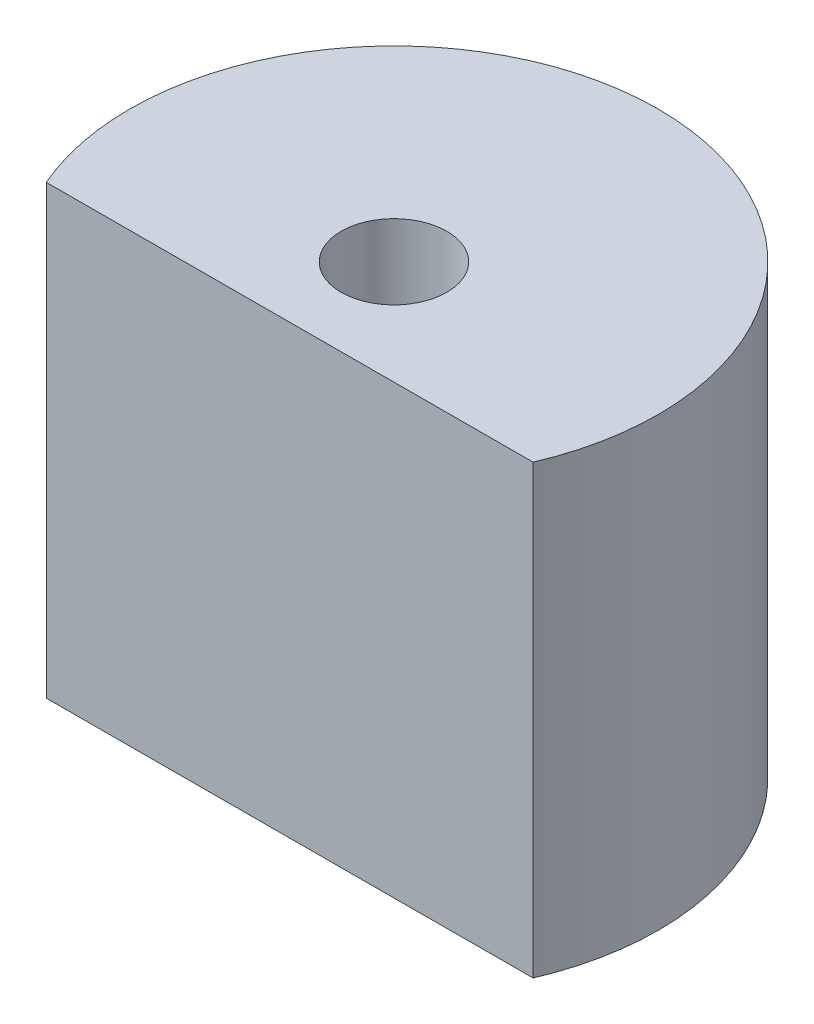
ISO-10303-21;
HEADER;
FILE_DESCRIPTION(('STEP AP214'),'2;1');
FILE_NAME('part.step','',(''),(''),'','','');
FILE_SCHEMA(('AUTOMOTIVE_DESIGN { 1 0 10303 214 1 1 1 1 }'));
ENDSEC;
DATA;
#1=APPLICATION_CONTEXT('core data for automotive mechanical design processes');
#2=APPLICATION_PROTOCOL_DEFINITION('international standard','automotive_design',2000,#1);
#3=PRODUCT_CONTEXT('',#1,'mechanical');
#4=PRODUCT('Part','Part','',(#3));
#5=PRODUCT_RELATED_PRODUCT_CATEGORY('part','',(#4));
#6=PRODUCT_DEFINITION_FORMATION('','',#4);
#7=PRODUCT_DEFINITION_CONTEXT('part definition',#1,'design');
#8=PRODUCT_DEFINITION('design','',#6,#7);
#9=PRODUCT_DEFINITION_SHAPE('','',#8);
#10=(LENGTH_UNIT() NAMED_UNIT(*) SI_UNIT(.MILLI.,.METRE.));
#11=(NAMED_UNIT(*) PLANE_ANGLE_UNIT() SI_UNIT($,.RADIAN.));
#12=(NAMED_UNIT(*) SI_UNIT($,.STERADIAN.) SOLID_ANGLE_UNIT());
#13=UNCERTAINTY_MEASURE_WITH_UNIT(LENGTH_MEASURE(1.E-05),#10,'distance_accuracy_value','');
#14=(GEOMETRIC_REPRESENTATION_CONTEXT(3) GLOBAL_UNCERTAINTY_ASSIGNED_CONTEXT((#13)) GLOBAL_UNIT_ASSIGNED_CONTEXT((#10,
#11,#12)) REPRESENTATION_CONTEXT('',''));
#15=CARTESIAN_POINT('',(0.,0.,0.));
#16=DIRECTION('',(0.,0.,1.));
#17=DIRECTION('',(1.,0.,0.));
#18=AXIS2_PLACEMENT_3D('',#15,#16,#17);
#19=CARTESIAN_POINT('',(0.,13.4112,0.));
#20=DIRECTION('',(0.,1.,0.));
#21=DIRECTION('',(0.,0.,1.));
#22=AXIS2_PLACEMENT_3D('',#19,#20,#21);
#23=PLANE('',#22);
#24=DIRECTION('',(-0.999997434066853,0.,0.00226536083440613));
#25=VECTOR('',#24,1.);
#26=CARTESIAN_POINT('',(0.00710669003863132,13.4112,3.13710367699671));
#27=LINE('',#26,#25);
#28=CARTESIAN_POINT('',(7.29834550402393,13.4112,3.12058634777084));
#29=VERTEX_POINT('',#28);
#30=CARTESIAN_POINT('',(-7.28413212394666,13.4112,3.15362100622257));
#31=VERTEX_POINT('',#30);
#32=EDGE_CURVE('E59',#29,#31,#27,.T.);
#33=ORIENTED_EDGE('',*,*,#32,.F.);
#34=CARTESIAN_POINT('',(0.,13.4112,0.));
#35=DIRECTION('',(0.,1.,0.));
#36=DIRECTION('',(0.,0.,1.));
#37=AXIS2_PLACEMENT_3D('',#34,#35,#36);
#38=CIRCLE('',#37,7.9375);
#39=EDGE_CURVE('E73',#29,#31,#38,.T.);
#40=ORIENTED_EDGE('',*,*,#39,.T.);
#41=EDGE_LOOP('',(#33,#40));
#42=FACE_BOUND('',#41,.T.);
#43=CARTESIAN_POINT('',(0.,13.4112,0.));
#44=DIRECTION('',(0.,1.,0.));
#45=DIRECTION('',(0.,0.,1.));
#46=AXIS2_PLACEMENT_3D('',#43,#44,#45);
#47=CIRCLE('',#46,1.5875);
#48=CARTESIAN_POINT('',(0.,13.4112,1.5875));
#49=VERTEX_POINT('',#48);
#50=EDGE_CURVE('E80',#49,#49,#47,.T.);
#51=ORIENTED_EDGE('',*,*,#50,.F.);
#52=EDGE_LOOP('',(#51));
#53=FACE_BOUND('',#52,.T.);
#54=ADVANCED_FACE('F44',(#42,#53),#23,.T.);
#55=CARTESIAN_POINT('',(0.,0.,0.));
#56=DIRECTION('',(0.,1.,0.));
#57=DIRECTION('',(0.,0.,1.));
#58=AXIS2_PLACEMENT_3D('',#55,#56,#57);
#59=PLANE('',#58);
#60=CARTESIAN_POINT('',(0.,0.,0.));
#61=DIRECTION('',(0.,1.,0.));
#62=DIRECTION('',(0.,0.,1.));
#63=AXIS2_PLACEMENT_3D('',#60,#61,#62);
#64=CIRCLE('',#63,7.9375);
#65=CARTESIAN_POINT('',(7.29834550402393,0.,3.12058634777084));
#66=VERTEX_POINT('',#65);
#67=CARTESIAN_POINT('',(-7.28413212394666,0.,3.15362100622257));
#68=VERTEX_POINT('',#67);
#69=EDGE_CURVE('E78',#66,#68,#64,.T.);
#70=ORIENTED_EDGE('',*,*,#69,.F.);
#71=DIRECTION('',(-0.999997434066853,0.,0.00226536083440613));
#72=VECTOR('',#71,1.);
#73=CARTESIAN_POINT('',(0.00710669003863132,0.,3.13710367699671));
#74=LINE('',#73,#72);
#75=EDGE_CURVE('E68',#66,#68,#74,.T.);
#76=ORIENTED_EDGE('',*,*,#75,.T.);
#77=EDGE_LOOP('',(#70,#76));
#78=FACE_BOUND('',#77,.T.);
#79=CARTESIAN_POINT('',(0.,0.,0.));
#80=DIRECTION('',(0.,1.,0.));
#81=DIRECTION('',(0.,0.,1.));
#82=AXIS2_PLACEMENT_3D('',#79,#80,#81);
#83=CIRCLE('',#82,1.5875);
#84=CARTESIAN_POINT('',(0.,0.,1.5875));
#85=VERTEX_POINT('',#84);
#86=EDGE_CURVE('E84',#85,#85,#83,.T.);
#87=ORIENTED_EDGE('',*,*,#86,.T.);
#88=EDGE_LOOP('',(#87));
#89=FACE_BOUND('',#88,.T.);
#90=ADVANCED_FACE('F76',(#78,#89),#59,.F.);
#91=CARTESIAN_POINT('',(0.,13.4112,0.));
#92=DIRECTION('',(0.,-1.,0.));
#93=DIRECTION('',(0.,0.,-1.));
#94=AXIS2_PLACEMENT_3D('',#91,#92,#93);
#95=CYLINDRICAL_SURFACE('',#94,7.9375);
#96=ORIENTED_EDGE('',*,*,#39,.F.);
#97=DIRECTION('',(0.,-1.,0.));
#98=VECTOR('',#97,1.);
#99=CARTESIAN_POINT('',(7.29834550402393,13.4112,3.12058634777084));
#100=LINE('',#99,#98);
#101=EDGE_CURVE('E13',#29,#66,#100,.T.);
#102=ORIENTED_EDGE('',*,*,#101,.T.);
#103=ORIENTED_EDGE('',*,*,#69,.T.);
#104=DIRECTION('',(0.,-1.,0.));
#105=VECTOR('',#104,1.);
#106=CARTESIAN_POINT('',(-7.28413212394666,13.4112,3.15362100622257));
#107=LINE('',#106,#105);
#108=EDGE_CURVE('E52',#68,#31,#107,.F.);
#109=ORIENTED_EDGE('',*,*,#108,.T.);
#110=EDGE_LOOP('',(#96,#102,#103,#109));
#111=FACE_BOUND('',#110,.T.);
#112=ADVANCED_FACE('F46',(#111),#95,.T.);
#113=CARTESIAN_POINT('',(0.,13.4112,0.));
#114=DIRECTION('',(0.,-1.,0.));
#115=DIRECTION('',(0.,0.,-1.));
#116=AXIS2_PLACEMENT_3D('',#113,#114,#115);
#117=CYLINDRICAL_SURFACE('',#116,1.5875);
#118=ORIENTED_EDGE('',*,*,#50,.T.);
#119=EDGE_LOOP('',(#118));
#120=FACE_BOUND('',#119,.T.);
#121=ORIENTED_EDGE('',*,*,#86,.F.);
#122=EDGE_LOOP('',(#121));
#123=FACE_BOUND('',#122,.T.);
#124=ADVANCED_FACE('F91',(#120,#123),#117,.F.);
#125=CARTESIAN_POINT('',(12.5817567918265,-49.4531499449741,3.10861748405609));
#126=DIRECTION('',(-0.00226536083440613,0.,-0.999997434066853));
#127=DIRECTION('',(-0.999997434066853,0.,0.00226536083440613));
#128=AXIS2_PLACEMENT_3D('',#125,#126,#127);
#129=PLANE('',#128);
#130=ORIENTED_EDGE('',*,*,#101,.F.);
#131=ORIENTED_EDGE('',*,*,#32,.T.);
#132=ORIENTED_EDGE('',*,*,#108,.F.);
#133=ORIENTED_EDGE('',*,*,#75,.F.);
#134=EDGE_LOOP('',(#130,#131,#132,#133));
#135=FACE_BOUND('',#134,.T.);
#136=ADVANCED_FACE('F67',(#135),#129,.F.);
#137=CLOSED_SHELL('',(#54,#90,#112,#124,#136));
#138=MANIFOLD_SOLID_BREP('B2',#137);
#139=ADVANCED_BREP_SHAPE_REPRESENTATION('',(#18,#138),#14);
#140=SHAPE_DEFINITION_REPRESENTATION(#9,#139);
ENDSEC;
END-ISO-10303-21;
